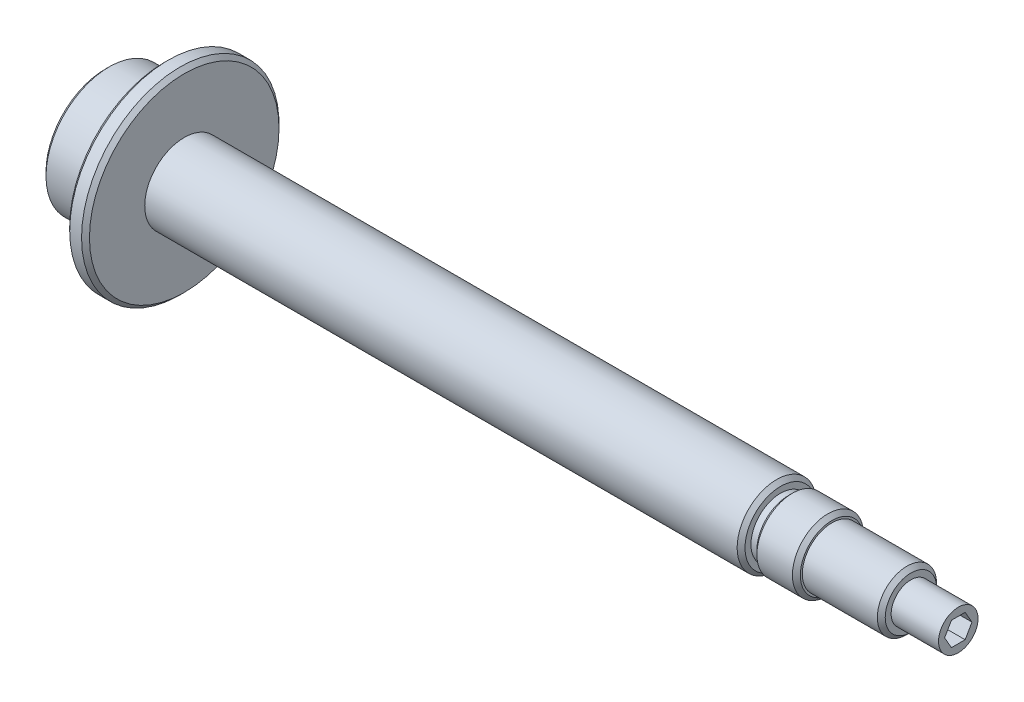
ISO-10303-21;
HEADER;
FILE_DESCRIPTION(('STEP AP214'),'2;1');
FILE_NAME('part.step','',(''),(''),'','','');
FILE_SCHEMA(('AUTOMOTIVE_DESIGN { 1 0 10303 214 1 1 1 1 }'));
ENDSEC;
DATA;
#1=APPLICATION_CONTEXT('core data for automotive mechanical design processes');
#2=APPLICATION_PROTOCOL_DEFINITION('international standard','automotive_design',2000,#1);
#3=PRODUCT_CONTEXT('',#1,'mechanical');
#4=PRODUCT('Part','Part','',(#3));
#5=PRODUCT_RELATED_PRODUCT_CATEGORY('part','',(#4));
#6=PRODUCT_DEFINITION_FORMATION('','',#4);
#7=PRODUCT_DEFINITION_CONTEXT('part definition',#1,'design');
#8=PRODUCT_DEFINITION('design','',#6,#7);
#9=PRODUCT_DEFINITION_SHAPE('','',#8);
#10=(LENGTH_UNIT() NAMED_UNIT(*) SI_UNIT(.MILLI.,.METRE.));
#11=(NAMED_UNIT(*) PLANE_ANGLE_UNIT() SI_UNIT($,.RADIAN.));
#12=(NAMED_UNIT(*) SI_UNIT($,.STERADIAN.) SOLID_ANGLE_UNIT());
#13=UNCERTAINTY_MEASURE_WITH_UNIT(LENGTH_MEASURE(1.E-05),#10,'distance_accuracy_value','');
#14=(GEOMETRIC_REPRESENTATION_CONTEXT(3) GLOBAL_UNCERTAINTY_ASSIGNED_CONTEXT((#13)) GLOBAL_UNIT_ASSIGNED_CONTEXT((#10,
#11,#12)) REPRESENTATION_CONTEXT('',''));
#15=CARTESIAN_POINT('',(0.,0.,0.));
#16=DIRECTION('',(0.,0.,1.));
#17=DIRECTION('',(1.,0.,0.));
#18=AXIS2_PLACEMENT_3D('',#15,#16,#17);
#19=CARTESIAN_POINT('',(0.,0.,0.));
#20=DIRECTION('',(1.,0.,0.));
#21=DIRECTION('',(0.,0.,-1.));
#22=AXIS2_PLACEMENT_3D('',#19,#20,#21);
#23=PLANE('',#22);
#24=CARTESIAN_POINT('',(0.,0.,0.));
#25=DIRECTION('',(-1.,0.,0.));
#26=DIRECTION('',(0.,0.,1.));
#27=AXIS2_PLACEMENT_3D('',#24,#25,#26);
#28=CIRCLE('',#27,5.025);
#29=CARTESIAN_POINT('',(0.,0.,5.025));
#30=VERTEX_POINT('',#29);
#31=EDGE_CURVE('E149',#30,#30,#28,.T.);
#32=ORIENTED_EDGE('',*,*,#31,.F.);
#33=EDGE_LOOP('',(#32));
#34=FACE_BOUND('',#33,.T.);
#35=CARTESIAN_POINT('',(0.,0.,0.));
#36=DIRECTION('',(-1.,0.,0.));
#37=DIRECTION('',(0.,0.,1.));
#38=AXIS2_PLACEMENT_3D('',#35,#36,#37);
#39=CIRCLE('',#38,15.);
#40=CARTESIAN_POINT('',(0.,0.,15.));
#41=VERTEX_POINT('',#40);
#42=EDGE_CURVE('E11',#41,#41,#39,.T.);
#43=ORIENTED_EDGE('',*,*,#42,.T.);
#44=EDGE_LOOP('',(#43));
#45=FACE_BOUND('',#44,.T.);
#46=ADVANCED_FACE('F50',(#34,#45),#23,.F.);
#47=CARTESIAN_POINT('',(1.,0.,0.));
#48=DIRECTION('',(1.,0.,0.));
#49=DIRECTION('',(0.,0.,-1.));
#50=AXIS2_PLACEMENT_3D('',#47,#48,#49);
#51=CONICAL_SURFACE('',#50,16.,0.785398163397449);
#52=ORIENTED_EDGE('',*,*,#42,.F.);
#53=EDGE_LOOP('',(#52));
#54=FACE_BOUND('',#53,.T.);
#55=CARTESIAN_POINT('',(1.,0.,0.));
#56=DIRECTION('',(-1.,0.,0.));
#57=DIRECTION('',(0.,0.,1.));
#58=AXIS2_PLACEMENT_3D('',#55,#56,#57);
#59=CIRCLE('',#58,16.);
#60=CARTESIAN_POINT('',(1.,0.,16.));
#61=VERTEX_POINT('',#60);
#62=EDGE_CURVE('E57',#61,#61,#59,.T.);
#63=ORIENTED_EDGE('',*,*,#62,.T.);
#64=EDGE_LOOP('',(#63));
#65=FACE_BOUND('',#64,.T.);
#66=ADVANCED_FACE('F224',(#54,#65),#51,.T.);
#67=CARTESIAN_POINT('',(0.,0.,0.));
#68=DIRECTION('',(-1.,0.,0.));
#69=DIRECTION('',(0.,0.,1.));
#70=AXIS2_PLACEMENT_3D('',#67,#68,#69);
#71=CYLINDRICAL_SURFACE('',#70,16.);
#72=ORIENTED_EDGE('',*,*,#62,.F.);
#73=EDGE_LOOP('',(#72));
#74=FACE_BOUND('',#73,.T.);
#75=CARTESIAN_POINT('',(15.,0.,0.));
#76=DIRECTION('',(-1.,0.,0.));
#77=DIRECTION('',(0.,0.,1.));
#78=AXIS2_PLACEMENT_3D('',#75,#76,#77);
#79=CIRCLE('',#78,16.);
#80=CARTESIAN_POINT('',(15.,0.,16.));
#81=VERTEX_POINT('',#80);
#82=EDGE_CURVE('E219',#81,#81,#79,.T.);
#83=ORIENTED_EDGE('',*,*,#82,.T.);
#84=EDGE_LOOP('',(#83));
#85=FACE_BOUND('',#84,.T.);
#86=ADVANCED_FACE('F226',(#74,#85),#71,.T.);
#87=CARTESIAN_POINT('',(15.,16.,0.));
#88=DIRECTION('',(1.,0.,0.));
#89=DIRECTION('',(0.,0.,-1.));
#90=AXIS2_PLACEMENT_3D('',#87,#88,#89);
#91=PLANE('',#90);
#92=ORIENTED_EDGE('',*,*,#82,.F.);
#93=EDGE_LOOP('',(#92));
#94=FACE_BOUND('',#93,.T.);
#95=CARTESIAN_POINT('',(15.,0.,0.));
#96=DIRECTION('',(-1.,0.,0.));
#97=DIRECTION('',(0.,0.,1.));
#98=AXIS2_PLACEMENT_3D('',#95,#96,#97);
#99=CIRCLE('',#98,24.);
#100=CARTESIAN_POINT('',(15.,0.,24.));
#101=VERTEX_POINT('',#100);
#102=EDGE_CURVE('E216',#101,#101,#99,.T.);
#103=ORIENTED_EDGE('',*,*,#102,.T.);
#104=EDGE_LOOP('',(#103));
#105=FACE_BOUND('',#104,.T.);
#106=ADVANCED_FACE('F229',(#94,#105),#91,.F.);
#107=CARTESIAN_POINT('',(16.,0.,0.));
#108=DIRECTION('',(1.,0.,0.));
#109=DIRECTION('',(0.,0.,-1.));
#110=AXIS2_PLACEMENT_3D('',#107,#108,#109);
#111=CONICAL_SURFACE('',#110,25.,0.785398163397448);
#112=ORIENTED_EDGE('',*,*,#102,.F.);
#113=EDGE_LOOP('',(#112));
#114=FACE_BOUND('',#113,.T.);
#115=CARTESIAN_POINT('',(16.,0.,0.));
#116=DIRECTION('',(-1.,0.,0.));
#117=DIRECTION('',(0.,0.,1.));
#118=AXIS2_PLACEMENT_3D('',#115,#116,#117);
#119=CIRCLE('',#118,25.);
#120=CARTESIAN_POINT('',(16.,0.,25.));
#121=VERTEX_POINT('',#120);
#122=EDGE_CURVE('E213',#121,#121,#119,.T.);
#123=ORIENTED_EDGE('',*,*,#122,.T.);
#124=EDGE_LOOP('',(#123));
#125=FACE_BOUND('',#124,.T.);
#126=ADVANCED_FACE('F235',(#114,#125),#111,.T.);
#127=CARTESIAN_POINT('',(0.,0.,0.));
#128=DIRECTION('',(-1.,0.,0.));
#129=DIRECTION('',(0.,0.,1.));
#130=AXIS2_PLACEMENT_3D('',#127,#128,#129);
#131=CYLINDRICAL_SURFACE('',#130,25.);
#132=ORIENTED_EDGE('',*,*,#122,.F.);
#133=EDGE_LOOP('',(#132));
#134=FACE_BOUND('',#133,.T.);
#135=CARTESIAN_POINT('',(19.,0.,0.));
#136=DIRECTION('',(-1.,0.,0.));
#137=DIRECTION('',(0.,0.,1.));
#138=AXIS2_PLACEMENT_3D('',#135,#136,#137);
#139=CIRCLE('',#138,25.);
#140=CARTESIAN_POINT('',(19.,0.,25.));
#141=VERTEX_POINT('',#140);
#142=EDGE_CURVE('E210',#141,#141,#139,.T.);
#143=ORIENTED_EDGE('',*,*,#142,.T.);
#144=EDGE_LOOP('',(#143));
#145=FACE_BOUND('',#144,.T.);
#146=ADVANCED_FACE('F241',(#134,#145),#131,.T.);
#147=CARTESIAN_POINT('',(20.,0.,0.));
#148=DIRECTION('',(-1.,0.,0.));
#149=DIRECTION('',(0.,0.,1.));
#150=AXIS2_PLACEMENT_3D('',#147,#148,#149);
#151=CONICAL_SURFACE('',#150,24.,0.785398163397448);
#152=ORIENTED_EDGE('',*,*,#142,.F.);
#153=EDGE_LOOP('',(#152));
#154=FACE_BOUND('',#153,.T.);
#155=CARTESIAN_POINT('',(20.,0.,0.));
#156=DIRECTION('',(-1.,0.,0.));
#157=DIRECTION('',(0.,0.,1.));
#158=AXIS2_PLACEMENT_3D('',#155,#156,#157);
#159=CIRCLE('',#158,24.);
#160=CARTESIAN_POINT('',(20.,0.,24.));
#161=VERTEX_POINT('',#160);
#162=EDGE_CURVE('E207',#161,#161,#159,.T.);
#163=ORIENTED_EDGE('',*,*,#162,.T.);
#164=EDGE_LOOP('',(#163));
#165=FACE_BOUND('',#164,.T.);
#166=ADVANCED_FACE('F247',(#154,#165),#151,.T.);
#167=CARTESIAN_POINT('',(20.,24.,0.));
#168=DIRECTION('',(-1.,0.,0.));
#169=DIRECTION('',(0.,0.,1.));
#170=AXIS2_PLACEMENT_3D('',#167,#168,#169);
#171=PLANE('',#170);
#172=ORIENTED_EDGE('',*,*,#162,.F.);
#173=EDGE_LOOP('',(#172));
#174=FACE_BOUND('',#173,.T.);
#175=CARTESIAN_POINT('',(20.,0.,0.));
#176=DIRECTION('',(-1.,0.,0.));
#177=DIRECTION('',(0.,0.,1.));
#178=AXIS2_PLACEMENT_3D('',#175,#176,#177);
#179=CIRCLE('',#178,10.);
#180=CARTESIAN_POINT('',(20.,0.,10.));
#181=VERTEX_POINT('',#180);
#182=EDGE_CURVE('E204',#181,#181,#179,.T.);
#183=ORIENTED_EDGE('',*,*,#182,.T.);
#184=EDGE_LOOP('',(#183));
#185=FACE_BOUND('',#184,.T.);
#186=ADVANCED_FACE('F253',(#174,#185),#171,.F.);
#187=CARTESIAN_POINT('',(0.,0.,0.));
#188=DIRECTION('',(-1.,0.,0.));
#189=DIRECTION('',(0.,0.,1.));
#190=AXIS2_PLACEMENT_3D('',#187,#188,#189);
#191=CYLINDRICAL_SURFACE('',#190,10.);
#192=ORIENTED_EDGE('',*,*,#182,.F.);
#193=EDGE_LOOP('',(#192));
#194=FACE_BOUND('',#193,.T.);
#195=CARTESIAN_POINT('',(170.,0.,0.));
#196=DIRECTION('',(-1.,0.,0.));
#197=DIRECTION('',(0.,0.,1.));
#198=AXIS2_PLACEMENT_3D('',#195,#196,#197);
#199=CIRCLE('',#198,10.);
#200=CARTESIAN_POINT('',(170.,0.,10.));
#201=VERTEX_POINT('',#200);
#202=EDGE_CURVE('E201',#201,#201,#199,.T.);
#203=ORIENTED_EDGE('',*,*,#202,.T.);
#204=EDGE_LOOP('',(#203));
#205=FACE_BOUND('',#204,.T.);
#206=ADVANCED_FACE('F259',(#194,#205),#191,.T.);
#207=CARTESIAN_POINT('',(171.,0.,0.));
#208=DIRECTION('',(-1.,0.,0.));
#209=DIRECTION('',(0.,0.,1.));
#210=AXIS2_PLACEMENT_3D('',#207,#208,#209);
#211=CONICAL_SURFACE('',#210,9.,0.785398163397447);
#212=ORIENTED_EDGE('',*,*,#202,.F.);
#213=EDGE_LOOP('',(#212));
#214=FACE_BOUND('',#213,.T.);
#215=CARTESIAN_POINT('',(171.,0.,0.));
#216=DIRECTION('',(-1.,0.,0.));
#217=DIRECTION('',(0.,0.,1.));
#218=AXIS2_PLACEMENT_3D('',#215,#216,#217);
#219=CIRCLE('',#218,9.);
#220=CARTESIAN_POINT('',(171.,0.,9.));
#221=VERTEX_POINT('',#220);
#222=EDGE_CURVE('E198',#221,#221,#219,.T.);
#223=ORIENTED_EDGE('',*,*,#222,.T.);
#224=EDGE_LOOP('',(#223));
#225=FACE_BOUND('',#224,.T.);
#226=ADVANCED_FACE('F265',(#214,#225),#211,.T.);
#227=CARTESIAN_POINT('',(171.,9.,0.));
#228=DIRECTION('',(-1.,0.,0.));
#229=DIRECTION('',(0.,0.,1.));
#230=AXIS2_PLACEMENT_3D('',#227,#228,#229);
#231=PLANE('',#230);
#232=ORIENTED_EDGE('',*,*,#222,.F.);
#233=EDGE_LOOP('',(#232));
#234=FACE_BOUND('',#233,.T.);
#235=CARTESIAN_POINT('',(171.,0.,0.));
#236=DIRECTION('',(-1.,0.,0.));
#237=DIRECTION('',(0.,0.,1.));
#238=AXIS2_PLACEMENT_3D('',#235,#236,#237);
#239=CIRCLE('',#238,7.5);
#240=CARTESIAN_POINT('',(171.,0.,7.5));
#241=VERTEX_POINT('',#240);
#242=EDGE_CURVE('E195',#241,#241,#239,.T.);
#243=ORIENTED_EDGE('',*,*,#242,.T.);
#244=EDGE_LOOP('',(#243));
#245=FACE_BOUND('',#244,.T.);
#246=ADVANCED_FACE('F271',(#234,#245),#231,.F.);
#247=CARTESIAN_POINT('',(0.,0.,0.));
#248=DIRECTION('',(-1.,0.,0.));
#249=DIRECTION('',(0.,0.,1.));
#250=AXIS2_PLACEMENT_3D('',#247,#248,#249);
#251=CYLINDRICAL_SURFACE('',#250,7.5);
#252=ORIENTED_EDGE('',*,*,#242,.F.);
#253=EDGE_LOOP('',(#252));
#254=FACE_BOUND('',#253,.T.);
#255=CARTESIAN_POINT('',(173.,0.,0.));
#256=DIRECTION('',(-1.,0.,0.));
#257=DIRECTION('',(0.,0.,1.));
#258=AXIS2_PLACEMENT_3D('',#255,#256,#257);
#259=CIRCLE('',#258,7.5);
#260=CARTESIAN_POINT('',(173.,0.,7.5));
#261=VERTEX_POINT('',#260);
#262=EDGE_CURVE('E192',#261,#261,#259,.T.);
#263=ORIENTED_EDGE('',*,*,#262,.T.);
#264=EDGE_LOOP('',(#263));
#265=FACE_BOUND('',#264,.T.);
#266=ADVANCED_FACE('F277',(#254,#265),#251,.T.);
#267=CARTESIAN_POINT('',(173.,7.5,0.));
#268=DIRECTION('',(1.,0.,0.));
#269=DIRECTION('',(0.,0.,-1.));
#270=AXIS2_PLACEMENT_3D('',#267,#268,#269);
#271=PLANE('',#270);
#272=ORIENTED_EDGE('',*,*,#262,.F.);
#273=EDGE_LOOP('',(#272));
#274=FACE_BOUND('',#273,.T.);
#275=CARTESIAN_POINT('',(173.,0.,0.));
#276=DIRECTION('',(-1.,0.,0.));
#277=DIRECTION('',(0.,0.,1.));
#278=AXIS2_PLACEMENT_3D('',#275,#276,#277);
#279=CIRCLE('',#278,8.);
#280=CARTESIAN_POINT('',(173.,0.,8.));
#281=VERTEX_POINT('',#280);
#282=EDGE_CURVE('E189',#281,#281,#279,.T.);
#283=ORIENTED_EDGE('',*,*,#282,.T.);
#284=EDGE_LOOP('',(#283));
#285=FACE_BOUND('',#284,.T.);
#286=ADVANCED_FACE('F283',(#274,#285),#271,.F.);
#287=CARTESIAN_POINT('',(174.,0.,0.));
#288=DIRECTION('',(1.,0.,0.));
#289=DIRECTION('',(0.,0.,-1.));
#290=AXIS2_PLACEMENT_3D('',#287,#288,#289);
#291=CONICAL_SURFACE('',#290,9.,0.785398163397447);
#292=ORIENTED_EDGE('',*,*,#282,.F.);
#293=EDGE_LOOP('',(#292));
#294=FACE_BOUND('',#293,.T.);
#295=CARTESIAN_POINT('',(174.,0.,0.));
#296=DIRECTION('',(-1.,0.,0.));
#297=DIRECTION('',(0.,0.,1.));
#298=AXIS2_PLACEMENT_3D('',#295,#296,#297);
#299=CIRCLE('',#298,9.);
#300=CARTESIAN_POINT('',(174.,0.,9.));
#301=VERTEX_POINT('',#300);
#302=EDGE_CURVE('E186',#301,#301,#299,.T.);
#303=ORIENTED_EDGE('',*,*,#302,.T.);
#304=EDGE_LOOP('',(#303));
#305=FACE_BOUND('',#304,.T.);
#306=ADVANCED_FACE('F289',(#294,#305),#291,.T.);
#307=CARTESIAN_POINT('',(0.,0.,0.));
#308=DIRECTION('',(-1.,0.,0.));
#309=DIRECTION('',(0.,0.,1.));
#310=AXIS2_PLACEMENT_3D('',#307,#308,#309);
#311=CYLINDRICAL_SURFACE('',#310,9.);
#312=ORIENTED_EDGE('',*,*,#302,.F.);
#313=EDGE_LOOP('',(#312));
#314=FACE_BOUND('',#313,.T.);
#315=CARTESIAN_POINT('',(183.,0.,0.));
#316=DIRECTION('',(-1.,0.,0.));
#317=DIRECTION('',(0.,0.,1.));
#318=AXIS2_PLACEMENT_3D('',#315,#316,#317);
#319=CIRCLE('',#318,9.);
#320=CARTESIAN_POINT('',(183.,0.,9.));
#321=VERTEX_POINT('',#320);
#322=EDGE_CURVE('E183',#321,#321,#319,.T.);
#323=ORIENTED_EDGE('',*,*,#322,.T.);
#324=EDGE_LOOP('',(#323));
#325=FACE_BOUND('',#324,.T.);
#326=ADVANCED_FACE('F295',(#314,#325),#311,.T.);
#327=CARTESIAN_POINT('',(184.,0.,0.));
#328=DIRECTION('',(-1.,0.,0.));
#329=DIRECTION('',(0.,0.,1.));
#330=AXIS2_PLACEMENT_3D('',#327,#328,#329);
#331=CONICAL_SURFACE('',#330,8.,0.785398163397447);
#332=ORIENTED_EDGE('',*,*,#322,.F.);
#333=EDGE_LOOP('',(#332));
#334=FACE_BOUND('',#333,.T.);
#335=CARTESIAN_POINT('',(184.,0.,0.));
#336=DIRECTION('',(-1.,0.,0.));
#337=DIRECTION('',(0.,0.,1.));
#338=AXIS2_PLACEMENT_3D('',#335,#336,#337);
#339=CIRCLE('',#338,8.);
#340=CARTESIAN_POINT('',(184.,0.,8.));
#341=VERTEX_POINT('',#340);
#342=EDGE_CURVE('E180',#341,#341,#339,.T.);
#343=ORIENTED_EDGE('',*,*,#342,.T.);
#344=EDGE_LOOP('',(#343));
#345=FACE_BOUND('',#344,.T.);
#346=ADVANCED_FACE('F301',(#334,#345),#331,.T.);
#347=CARTESIAN_POINT('',(184.,8.,0.));
#348=DIRECTION('',(-1.,0.,0.));
#349=DIRECTION('',(0.,0.,1.));
#350=AXIS2_PLACEMENT_3D('',#347,#348,#349);
#351=PLANE('',#350);
#352=ORIENTED_EDGE('',*,*,#342,.F.);
#353=EDGE_LOOP('',(#352));
#354=FACE_BOUND('',#353,.T.);
#355=CARTESIAN_POINT('',(184.,0.,0.));
#356=DIRECTION('',(-1.,0.,0.));
#357=DIRECTION('',(0.,0.,1.));
#358=AXIS2_PLACEMENT_3D('',#355,#356,#357);
#359=CIRCLE('',#358,7.5);
#360=CARTESIAN_POINT('',(184.,0.,7.5));
#361=VERTEX_POINT('',#360);
#362=EDGE_CURVE('E177',#361,#361,#359,.T.);
#363=ORIENTED_EDGE('',*,*,#362,.T.);
#364=EDGE_LOOP('',(#363));
#365=FACE_BOUND('',#364,.T.);
#366=ADVANCED_FACE('F307',(#354,#365),#351,.F.);
#367=CARTESIAN_POINT('',(0.,0.,0.));
#368=DIRECTION('',(-1.,0.,0.));
#369=DIRECTION('',(0.,0.,1.));
#370=AXIS2_PLACEMENT_3D('',#367,#368,#369);
#371=CYLINDRICAL_SURFACE('',#370,7.5);
#372=ORIENTED_EDGE('',*,*,#362,.F.);
#373=EDGE_LOOP('',(#372));
#374=FACE_BOUND('',#373,.T.);
#375=CARTESIAN_POINT('',(203.,0.,0.));
#376=DIRECTION('',(-1.,0.,0.));
#377=DIRECTION('',(0.,0.,1.));
#378=AXIS2_PLACEMENT_3D('',#375,#376,#377);
#379=CIRCLE('',#378,7.5);
#380=CARTESIAN_POINT('',(203.,0.,7.5));
#381=VERTEX_POINT('',#380);
#382=EDGE_CURVE('E174',#381,#381,#379,.T.);
#383=ORIENTED_EDGE('',*,*,#382,.T.);
#384=EDGE_LOOP('',(#383));
#385=FACE_BOUND('',#384,.T.);
#386=ADVANCED_FACE('F313',(#374,#385),#371,.T.);
#387=CARTESIAN_POINT('',(204.,0.,0.));
#388=DIRECTION('',(-1.,0.,0.));
#389=DIRECTION('',(0.,0.,1.));
#390=AXIS2_PLACEMENT_3D('',#387,#388,#389);
#391=CONICAL_SURFACE('',#390,6.5,0.785398163397448);
#392=ORIENTED_EDGE('',*,*,#382,.F.);
#393=EDGE_LOOP('',(#392));
#394=FACE_BOUND('',#393,.T.);
#395=CARTESIAN_POINT('',(204.,0.,0.));
#396=DIRECTION('',(-1.,0.,0.));
#397=DIRECTION('',(0.,0.,1.));
#398=AXIS2_PLACEMENT_3D('',#395,#396,#397);
#399=CIRCLE('',#398,6.5);
#400=CARTESIAN_POINT('',(204.,0.,6.5));
#401=VERTEX_POINT('',#400);
#402=EDGE_CURVE('E171',#401,#401,#399,.T.);
#403=ORIENTED_EDGE('',*,*,#402,.T.);
#404=EDGE_LOOP('',(#403));
#405=FACE_BOUND('',#404,.T.);
#406=ADVANCED_FACE('F319',(#394,#405),#391,.T.);
#407=CARTESIAN_POINT('',(204.,6.5,0.));
#408=DIRECTION('',(-1.,0.,0.));
#409=DIRECTION('',(0.,0.,1.));
#410=AXIS2_PLACEMENT_3D('',#407,#408,#409);
#411=PLANE('',#410);
#412=ORIENTED_EDGE('',*,*,#402,.F.);
#413=EDGE_LOOP('',(#412));
#414=FACE_BOUND('',#413,.T.);
#415=CARTESIAN_POINT('',(204.,0.,0.));
#416=DIRECTION('',(-1.,0.,0.));
#417=DIRECTION('',(0.,0.,1.));
#418=AXIS2_PLACEMENT_3D('',#415,#416,#417);
#419=CIRCLE('',#418,5.00000000000005);
#420=CARTESIAN_POINT('',(204.,0.,5.00000000000005));
#421=VERTEX_POINT('',#420);
#422=EDGE_CURVE('E168',#421,#421,#419,.T.);
#423=ORIENTED_EDGE('',*,*,#422,.T.);
#424=EDGE_LOOP('',(#423));
#425=FACE_BOUND('',#424,.T.);
#426=ADVANCED_FACE('F325',(#414,#425),#411,.F.);
#427=CARTESIAN_POINT('',(0.,0.,0.));
#428=DIRECTION('',(-1.,0.,0.));
#429=DIRECTION('',(0.,0.,1.));
#430=AXIS2_PLACEMENT_3D('',#427,#428,#429);
#431=CYLINDRICAL_SURFACE('',#430,5.00000000000005);
#432=ORIENTED_EDGE('',*,*,#422,.F.);
#433=EDGE_LOOP('',(#432));
#434=FACE_BOUND('',#433,.T.);
#435=CARTESIAN_POINT('',(216.,0.,0.));
#436=DIRECTION('',(-1.,0.,0.));
#437=DIRECTION('',(0.,0.,1.));
#438=AXIS2_PLACEMENT_3D('',#435,#436,#437);
#439=CIRCLE('',#438,5.00000000000005);
#440=CARTESIAN_POINT('',(216.,0.,5.00000000000005));
#441=VERTEX_POINT('',#440);
#442=EDGE_CURVE('E165',#441,#441,#439,.T.);
#443=ORIENTED_EDGE('',*,*,#442,.T.);
#444=EDGE_LOOP('',(#443));
#445=FACE_BOUND('',#444,.T.);
#446=ADVANCED_FACE('F331',(#434,#445),#431,.T.);
#447=CARTESIAN_POINT('',(216.,4.00000000000008,0.));
#448=DIRECTION('',(-1.,0.,0.));
#449=DIRECTION('',(0.,0.,1.));
#450=AXIS2_PLACEMENT_3D('',#447,#448,#449);
#451=PLANE('',#450);
#452=DIRECTION('',(0.,0.866025403784438,0.5));
#453=VECTOR('',#452,1.);
#454=CARTESIAN_POINT('',(216.,0.,-3.46410161513775));
#455=LINE('',#454,#453);
#456=CARTESIAN_POINT('',(216.,0.,-3.46410161513775));
#457=VERTEX_POINT('',#456);
#458=CARTESIAN_POINT('',(216.,3.,-1.73205080756888));
#459=VERTEX_POINT('',#458);
#460=EDGE_CURVE('E137',#457,#459,#455,.T.);
#461=ORIENTED_EDGE('',*,*,#460,.F.);
#462=DIRECTION('',(0.,0.866025403784439,-0.5));
#463=VECTOR('',#462,1.);
#464=CARTESIAN_POINT('',(216.,-3.,-1.73205080756888));
#465=LINE('',#464,#463);
#466=CARTESIAN_POINT('',(216.,-3.,-1.73205080756888));
#467=VERTEX_POINT('',#466);
#468=EDGE_CURVE('E64',#467,#457,#465,.T.);
#469=ORIENTED_EDGE('',*,*,#468,.F.);
#470=DIRECTION('',(0.,0.,-1.));
#471=VECTOR('',#470,1.);
#472=CARTESIAN_POINT('',(216.,-3.,1.73205080756888));
#473=LINE('',#472,#471);
#474=CARTESIAN_POINT('',(216.,-3.,1.73205080756888));
#475=VERTEX_POINT('',#474);
#476=EDGE_CURVE('E123',#475,#467,#473,.T.);
#477=ORIENTED_EDGE('',*,*,#476,.F.);
#478=DIRECTION('',(0.,-0.866025403784439,-0.5));
#479=VECTOR('',#478,1.);
#480=CARTESIAN_POINT('',(216.,0.,3.46410161513775));
#481=LINE('',#480,#479);
#482=CARTESIAN_POINT('',(216.,0.,3.46410161513775));
#483=VERTEX_POINT('',#482);
#484=EDGE_CURVE('E126',#483,#475,#481,.T.);
#485=ORIENTED_EDGE('',*,*,#484,.F.);
#486=DIRECTION('',(0.,-0.866025403784439,0.5));
#487=VECTOR('',#486,1.);
#488=CARTESIAN_POINT('',(216.,3.,1.73205080756888));
#489=LINE('',#488,#487);
#490=CARTESIAN_POINT('',(216.,3.,1.73205080756888));
#491=VERTEX_POINT('',#490);
#492=EDGE_CURVE('E142',#491,#483,#489,.T.);
#493=ORIENTED_EDGE('',*,*,#492,.F.);
#494=DIRECTION('',(0.,0.,1.));
#495=VECTOR('',#494,1.);
#496=CARTESIAN_POINT('',(216.,3.,-1.73205080756888));
#497=LINE('',#496,#495);
#498=EDGE_CURVE('E139',#459,#491,#497,.T.);
#499=ORIENTED_EDGE('',*,*,#498,.F.);
#500=EDGE_LOOP('',(#461,#469,#477,#485,#493,#499));
#501=FACE_BOUND('',#500,.T.);
#502=ORIENTED_EDGE('',*,*,#442,.F.);
#503=EDGE_LOOP('',(#502));
#504=FACE_BOUND('',#503,.T.);
#505=ADVANCED_FACE('F337',(#501,#504),#451,.F.);
#506=CARTESIAN_POINT('',(24.9463423691329,0.,0.));
#507=DIRECTION('',(-1.,0.,0.));
#508=DIRECTION('',(0.,0.,1.));
#509=AXIS2_PLACEMENT_3D('',#506,#507,#508);
#510=CONICAL_SURFACE('',#509,4.24999999999999,1.02974425867665);
#511=CARTESIAN_POINT('',(27.5,0.,0.));
#512=VERTEX_POINT('',#511);
#513=VERTEX_LOOP('',#512);
#514=FACE_BOUND('',#513,.T.);
#515=CARTESIAN_POINT('',(24.9463423691329,0.,0.));
#516=DIRECTION('',(-1.,0.,0.));
#517=DIRECTION('',(0.,0.,1.));
#518=AXIS2_PLACEMENT_3D('',#515,#516,#517);
#519=CIRCLE('',#518,4.24999999999999);
#520=CARTESIAN_POINT('',(24.9463423691329,0.,4.24999999999999));
#521=VERTEX_POINT('',#520);
#522=EDGE_CURVE('E162',#521,#521,#519,.T.);
#523=ORIENTED_EDGE('',*,*,#522,.T.);
#524=EDGE_LOOP('',(#523));
#525=FACE_BOUND('',#524,.T.);
#526=ADVANCED_FACE('F342',(#514,#525),#510,.F.);
#527=CARTESIAN_POINT('',(0.,0.,0.));
#528=DIRECTION('',(-1.,0.,0.));
#529=DIRECTION('',(0.,0.,1.));
#530=AXIS2_PLACEMENT_3D('',#527,#528,#529);
#531=CYLINDRICAL_SURFACE('',#530,4.24999999999999);
#532=ORIENTED_EDGE('',*,*,#522,.F.);
#533=EDGE_LOOP('',(#532));
#534=FACE_BOUND('',#533,.T.);
#535=CARTESIAN_POINT('',(0.775000000000005,0.,0.));
#536=DIRECTION('',(-1.,0.,0.));
#537=DIRECTION('',(0.,0.,1.));
#538=AXIS2_PLACEMENT_3D('',#535,#536,#537);
#539=CIRCLE('',#538,4.25);
#540=CARTESIAN_POINT('',(0.775000000000005,0.,4.25));
#541=VERTEX_POINT('',#540);
#542=EDGE_CURVE('E159',#541,#541,#539,.T.);
#543=ORIENTED_EDGE('',*,*,#542,.T.);
#544=EDGE_LOOP('',(#543));
#545=FACE_BOUND('',#544,.T.);
#546=ADVANCED_FACE('F350',(#534,#545),#531,.F.);
#547=CARTESIAN_POINT('',(0.,0.,0.));
#548=DIRECTION('',(-1.,0.,0.));
#549=DIRECTION('',(0.,0.,1.));
#550=AXIS2_PLACEMENT_3D('',#547,#548,#549);
#551=CONICAL_SURFACE('',#550,5.025,0.785398163397448);
#552=ORIENTED_EDGE('',*,*,#542,.F.);
#553=EDGE_LOOP('',(#552));
#554=FACE_BOUND('',#553,.T.);
#555=ORIENTED_EDGE('',*,*,#31,.T.);
#556=EDGE_LOOP('',(#555));
#557=FACE_BOUND('',#556,.T.);
#558=ADVANCED_FACE('F363',(#554,#557),#551,.F.);
#559=CARTESIAN_POINT('',(201.,-3.,-1.73205080756888));
#560=DIRECTION('',(0.,-0.5,-0.866025403784438));
#561=DIRECTION('',(0.,0.866025403784439,-0.5));
#562=AXIS2_PLACEMENT_3D('',#559,#560,#561);
#563=PLANE('',#562);
#564=ORIENTED_EDGE('',*,*,#468,.T.);
#565=DIRECTION('',(1.,0.,0.));
#566=VECTOR('',#565,1.);
#567=CARTESIAN_POINT('',(201.,0.,-3.46410161513775));
#568=LINE('',#567,#566);
#569=CARTESIAN_POINT('',(201.,0.,-3.46410161513775));
#570=VERTEX_POINT('',#569);
#571=EDGE_CURVE('E100',#570,#457,#568,.T.);
#572=ORIENTED_EDGE('',*,*,#571,.F.);
#573=DIRECTION('',(0.,0.866025403784439,-0.5));
#574=VECTOR('',#573,1.);
#575=CARTESIAN_POINT('',(201.,-3.,-1.73205080756888));
#576=LINE('',#575,#574);
#577=CARTESIAN_POINT('',(201.,-3.,-1.73205080756888));
#578=VERTEX_POINT('',#577);
#579=EDGE_CURVE('E104',#578,#570,#576,.T.);
#580=ORIENTED_EDGE('',*,*,#579,.F.);
#581=DIRECTION('',(1.,0.,0.));
#582=VECTOR('',#581,1.);
#583=CARTESIAN_POINT('',(201.,-3.,-1.73205080756888));
#584=LINE('',#583,#582);
#585=EDGE_CURVE('E147',#578,#467,#584,.T.);
#586=ORIENTED_EDGE('',*,*,#585,.T.);
#587=EDGE_LOOP('',(#564,#572,#580,#586));
#588=FACE_BOUND('',#587,.T.);
#589=ADVANCED_FACE('F102',(#588),#563,.F.);
#590=CARTESIAN_POINT('',(201.,-3.,1.73205080756888));
#591=DIRECTION('',(0.,-1.,0.));
#592=DIRECTION('',(0.,0.,-1.));
#593=AXIS2_PLACEMENT_3D('',#590,#591,#592);
#594=PLANE('',#593);
#595=ORIENTED_EDGE('',*,*,#476,.T.);
#596=ORIENTED_EDGE('',*,*,#585,.F.);
#597=DIRECTION('',(0.,0.,-1.));
#598=VECTOR('',#597,1.);
#599=CARTESIAN_POINT('',(201.,-3.,1.73205080756888));
#600=LINE('',#599,#598);
#601=CARTESIAN_POINT('',(201.,-3.,1.73205080756888));
#602=VERTEX_POINT('',#601);
#603=EDGE_CURVE('E110',#602,#578,#600,.T.);
#604=ORIENTED_EDGE('',*,*,#603,.F.);
#605=DIRECTION('',(1.,0.,0.));
#606=VECTOR('',#605,1.);
#607=CARTESIAN_POINT('',(201.,-3.,1.73205080756888));
#608=LINE('',#607,#606);
#609=EDGE_CURVE('E150',#602,#475,#608,.T.);
#610=ORIENTED_EDGE('',*,*,#609,.T.);
#611=EDGE_LOOP('',(#595,#596,#604,#610));
#612=FACE_BOUND('',#611,.T.);
#613=ADVANCED_FACE('F369',(#612),#594,.F.);
#614=CARTESIAN_POINT('',(201.,0.,3.46410161513775));
#615=DIRECTION('',(0.,-0.5,0.866025403784439));
#616=DIRECTION('',(0.,-0.866025403784439,-0.5));
#617=AXIS2_PLACEMENT_3D('',#614,#615,#616);
#618=PLANE('',#617);
#619=ORIENTED_EDGE('',*,*,#484,.T.);
#620=ORIENTED_EDGE('',*,*,#609,.F.);
#621=DIRECTION('',(0.,-0.866025403784439,-0.5));
#622=VECTOR('',#621,1.);
#623=CARTESIAN_POINT('',(201.,0.,3.46410161513775));
#624=LINE('',#623,#622);
#625=CARTESIAN_POINT('',(201.,0.,3.46410161513775));
#626=VERTEX_POINT('',#625);
#627=EDGE_CURVE('E133',#626,#602,#624,.T.);
#628=ORIENTED_EDGE('',*,*,#627,.F.);
#629=DIRECTION('',(1.,0.,0.));
#630=VECTOR('',#629,1.);
#631=CARTESIAN_POINT('',(201.,0.,3.46410161513775));
#632=LINE('',#631,#630);
#633=EDGE_CURVE('E152',#626,#483,#632,.T.);
#634=ORIENTED_EDGE('',*,*,#633,.T.);
#635=EDGE_LOOP('',(#619,#620,#628,#634));
#636=FACE_BOUND('',#635,.T.);
#637=ADVANCED_FACE('F385',(#636),#618,.F.);
#638=CARTESIAN_POINT('',(201.,3.,1.73205080756888));
#639=DIRECTION('',(0.,0.5,0.866025403784439));
#640=DIRECTION('',(0.,-0.866025403784439,0.5));
#641=AXIS2_PLACEMENT_3D('',#638,#639,#640);
#642=PLANE('',#641);
#643=ORIENTED_EDGE('',*,*,#492,.T.);
#644=ORIENTED_EDGE('',*,*,#633,.F.);
#645=DIRECTION('',(0.,-0.866025403784439,0.5));
#646=VECTOR('',#645,1.);
#647=CARTESIAN_POINT('',(201.,3.,1.73205080756888));
#648=LINE('',#647,#646);
#649=CARTESIAN_POINT('',(201.,3.,1.73205080756888));
#650=VERTEX_POINT('',#649);
#651=EDGE_CURVE('E130',#650,#626,#648,.T.);
#652=ORIENTED_EDGE('',*,*,#651,.F.);
#653=DIRECTION('',(1.,0.,0.));
#654=VECTOR('',#653,1.);
#655=CARTESIAN_POINT('',(201.,3.,1.73205080756888));
#656=LINE('',#655,#654);
#657=EDGE_CURVE('E154',#650,#491,#656,.T.);
#658=ORIENTED_EDGE('',*,*,#657,.T.);
#659=EDGE_LOOP('',(#643,#644,#652,#658));
#660=FACE_BOUND('',#659,.T.);
#661=ADVANCED_FACE('F381',(#660),#642,.F.);
#662=CARTESIAN_POINT('',(201.,3.,-1.73205080756888));
#663=DIRECTION('',(0.,1.,0.));
#664=DIRECTION('',(0.,0.,1.));
#665=AXIS2_PLACEMENT_3D('',#662,#663,#664);
#666=PLANE('',#665);
#667=ORIENTED_EDGE('',*,*,#498,.T.);
#668=ORIENTED_EDGE('',*,*,#657,.F.);
#669=DIRECTION('',(0.,0.,1.));
#670=VECTOR('',#669,1.);
#671=CARTESIAN_POINT('',(201.,3.,-1.73205080756888));
#672=LINE('',#671,#670);
#673=CARTESIAN_POINT('',(201.,3.,-1.73205080756888));
#674=VERTEX_POINT('',#673);
#675=EDGE_CURVE('E118',#674,#650,#672,.T.);
#676=ORIENTED_EDGE('',*,*,#675,.F.);
#677=DIRECTION('',(1.,0.,0.));
#678=VECTOR('',#677,1.);
#679=CARTESIAN_POINT('',(201.,3.,-1.73205080756888));
#680=LINE('',#679,#678);
#681=EDGE_CURVE('E109',#674,#459,#680,.T.);
#682=ORIENTED_EDGE('',*,*,#681,.T.);
#683=EDGE_LOOP('',(#667,#668,#676,#682));
#684=FACE_BOUND('',#683,.T.);
#685=ADVANCED_FACE('F378',(#684),#666,.F.);
#686=CARTESIAN_POINT('',(201.,0.,-3.46410161513775));
#687=DIRECTION('',(0.,0.5,-0.866025403784438));
#688=DIRECTION('',(0.,0.866025403784438,0.5));
#689=AXIS2_PLACEMENT_3D('',#686,#687,#688);
#690=PLANE('',#689);
#691=ORIENTED_EDGE('',*,*,#460,.T.);
#692=ORIENTED_EDGE('',*,*,#681,.F.);
#693=DIRECTION('',(0.,0.866025403784438,0.5));
#694=VECTOR('',#693,1.);
#695=CARTESIAN_POINT('',(201.,0.,-3.46410161513775));
#696=LINE('',#695,#694);
#697=EDGE_CURVE('E113',#570,#674,#696,.T.);
#698=ORIENTED_EDGE('',*,*,#697,.F.);
#699=ORIENTED_EDGE('',*,*,#571,.T.);
#700=EDGE_LOOP('',(#691,#692,#698,#699));
#701=FACE_BOUND('',#700,.T.);
#702=ADVANCED_FACE('F114',(#701),#690,.F.);
#703=CARTESIAN_POINT('',(201.,0.,0.));
#704=DIRECTION('',(1.,0.,0.));
#705=DIRECTION('',(0.,0.,-1.));
#706=AXIS2_PLACEMENT_3D('',#703,#704,#705);
#707=PLANE('',#706);
#708=ORIENTED_EDGE('',*,*,#579,.T.);
#709=ORIENTED_EDGE('',*,*,#697,.T.);
#710=ORIENTED_EDGE('',*,*,#675,.T.);
#711=ORIENTED_EDGE('',*,*,#651,.T.);
#712=ORIENTED_EDGE('',*,*,#627,.T.);
#713=ORIENTED_EDGE('',*,*,#603,.T.);
#714=EDGE_LOOP('',(#708,#709,#710,#711,#712,#713));
#715=FACE_BOUND('',#714,.T.);
#716=ADVANCED_FACE('F120',(#715),#707,.T.);
#717=CLOSED_SHELL('',(#46,#66,#86,#106,#126,#146,#166,#186,#206,#226,#246,#266,#286,#306,#326,
#346,#366,#386,#406,#426,#446,#505,#526,#546,#558,#589,#613,#637,#661,#685,#702,#716));
#718=MANIFOLD_SOLID_BREP('B2',#717);
#719=ADVANCED_BREP_SHAPE_REPRESENTATION('',(#18,#718),#14);
#720=SHAPE_DEFINITION_REPRESENTATION(#9,#719);
ENDSEC;
END-ISO-10303-21;
